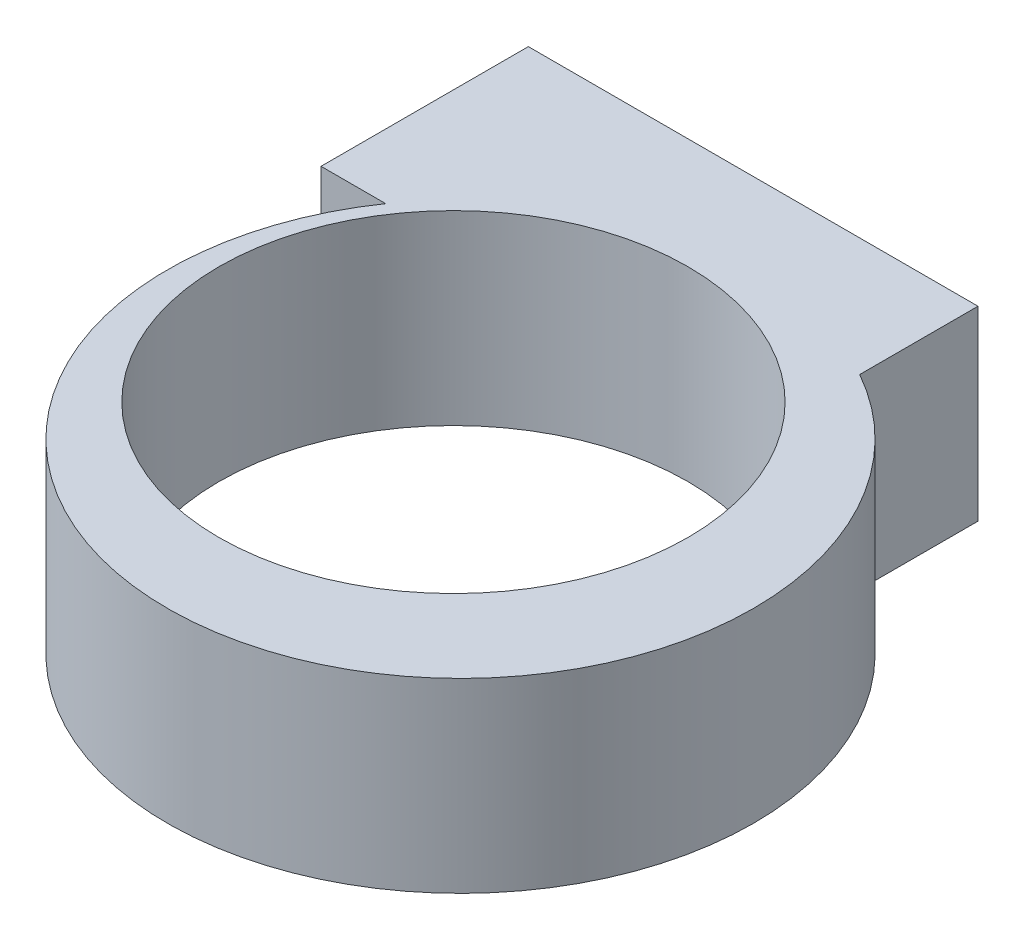
ISO-10303-21;
HEADER;
FILE_DESCRIPTION(('STEP AP214'),'2;1');
FILE_NAME('part.step','',(''),(''),'','','');
FILE_SCHEMA(('AUTOMOTIVE_DESIGN { 1 0 10303 214 1 1 1 1 }'));
ENDSEC;
DATA;
#1=APPLICATION_CONTEXT('core data for automotive mechanical design processes');
#2=APPLICATION_PROTOCOL_DEFINITION('international standard','automotive_design',2000,#1);
#3=PRODUCT_CONTEXT('',#1,'mechanical');
#4=PRODUCT('Part','Part','',(#3));
#5=PRODUCT_RELATED_PRODUCT_CATEGORY('part','',(#4));
#6=PRODUCT_DEFINITION_FORMATION('','',#4);
#7=PRODUCT_DEFINITION_CONTEXT('part definition',#1,'design');
#8=PRODUCT_DEFINITION('design','',#6,#7);
#9=PRODUCT_DEFINITION_SHAPE('','',#8);
#10=(LENGTH_UNIT() NAMED_UNIT(*) SI_UNIT(.MILLI.,.METRE.));
#11=(NAMED_UNIT(*) PLANE_ANGLE_UNIT() SI_UNIT($,.RADIAN.));
#12=(NAMED_UNIT(*) SI_UNIT($,.STERADIAN.) SOLID_ANGLE_UNIT());
#13=UNCERTAINTY_MEASURE_WITH_UNIT(LENGTH_MEASURE(1.E-05),#10,'distance_accuracy_value','');
#14=(GEOMETRIC_REPRESENTATION_CONTEXT(3) GLOBAL_UNCERTAINTY_ASSIGNED_CONTEXT((#13)) GLOBAL_UNIT_ASSIGNED_CONTEXT((#10,
#11,#12)) REPRESENTATION_CONTEXT('',''));
#15=CARTESIAN_POINT('',(0.,0.,0.));
#16=DIRECTION('',(0.,0.,1.));
#17=DIRECTION('',(1.,0.,0.));
#18=AXIS2_PLACEMENT_3D('',#15,#16,#17);
#19=CARTESIAN_POINT('',(0.,3.175,0.));
#20=DIRECTION('',(0.,-1.,0.));
#21=DIRECTION('',(0.,0.,-1.));
#22=AXIS2_PLACEMENT_3D('',#19,#20,#21);
#23=CYLINDRICAL_SURFACE('',#22,5.);
#24=CARTESIAN_POINT('',(0.,0.,0.));
#25=DIRECTION('',(0.,1.,0.));
#26=DIRECTION('',(0.,0.,1.));
#27=AXIS2_PLACEMENT_3D('',#24,#25,#26);
#28=CIRCLE('',#27,5.);
#29=CARTESIAN_POINT('',(-4.11530309650249,0.,-2.8397676707641));
#30=VERTEX_POINT('',#29);
#31=CARTESIAN_POINT('',(2.45078819699529,0.,-4.358169020755));
#32=VERTEX_POINT('',#31);
#33=EDGE_CURVE('E36',#30,#32,#28,.T.);
#34=ORIENTED_EDGE('',*,*,#33,.T.);
#35=DIRECTION('',(0.,-1.,0.));
#36=VECTOR('',#35,1.);
#37=CARTESIAN_POINT('',(2.45078819699529,3.175,-4.358169020755));
#38=LINE('',#37,#36);
#39=CARTESIAN_POINT('',(2.45078819699529,3.175,-4.358169020755));
#40=VERTEX_POINT('',#39);
#41=EDGE_CURVE('E50',#32,#40,#38,.F.);
#42=ORIENTED_EDGE('',*,*,#41,.T.);
#43=CARTESIAN_POINT('',(0.,3.175,0.));
#44=DIRECTION('',(0.,1.,0.));
#45=DIRECTION('',(0.,0.,1.));
#46=AXIS2_PLACEMENT_3D('',#43,#44,#45);
#47=CIRCLE('',#46,5.);
#48=CARTESIAN_POINT('',(-4.11530309650249,3.175,-2.8397676707641));
#49=VERTEX_POINT('',#48);
#50=EDGE_CURVE('E11',#49,#40,#47,.T.);
#51=ORIENTED_EDGE('',*,*,#50,.F.);
#52=DIRECTION('',(0.,-1.,0.));
#53=VECTOR('',#52,1.);
#54=CARTESIAN_POINT('',(-4.11530309650249,3.175,-2.8397676707641));
#55=LINE('',#54,#53);
#56=EDGE_CURVE('E93',#49,#30,#55,.T.);
#57=ORIENTED_EDGE('',*,*,#56,.T.);
#58=EDGE_LOOP('',(#34,#42,#51,#57));
#59=FACE_BOUND('',#58,.T.);
#60=ADVANCED_FACE('F33',(#59),#23,.T.);
#61=CARTESIAN_POINT('',(0.,3.175,0.));
#62=DIRECTION('',(0.,1.,0.));
#63=DIRECTION('',(0.,0.,1.));
#64=AXIS2_PLACEMENT_3D('',#61,#62,#63);
#65=PLANE('',#64);
#66=CARTESIAN_POINT('',(-0.606472723816864,3.175,-0.486614050174694));
#67=DIRECTION('',(0.,1.,0.));
#68=DIRECTION('',(0.,0.,1.));
#69=AXIS2_PLACEMENT_3D('',#66,#67,#68);
#70=CIRCLE('',#69,3.99999999999999);
#71=CARTESIAN_POINT('',(-0.606472723816864,3.175,3.51338594982529));
#72=VERTEX_POINT('',#71);
#73=EDGE_CURVE('E102',#72,#72,#70,.T.);
#74=ORIENTED_EDGE('',*,*,#73,.F.);
#75=EDGE_LOOP('',(#74));
#76=FACE_BOUND('',#75,.T.);
#77=ORIENTED_EDGE('',*,*,#50,.T.);
#78=DIRECTION('',(0.,0.,-1.));
#79=VECTOR('',#78,1.);
#80=CARTESIAN_POINT('',(2.45078819699529,3.175,-2.8397676707641));
#81=LINE('',#80,#79);
#82=CARTESIAN_POINT('',(2.45078819699529,3.175,-6.37568240648534));
#83=VERTEX_POINT('',#82);
#84=EDGE_CURVE('E95',#40,#83,#81,.T.);
#85=ORIENTED_EDGE('',*,*,#84,.T.);
#86=DIRECTION('',(-1.,0.,0.));
#87=VECTOR('',#86,1.);
#88=CARTESIAN_POINT('',(-5.21833840645058,3.175,-6.37568240648534));
#89=LINE('',#88,#87);
#90=CARTESIAN_POINT('',(-5.21833840645058,3.175,-6.37568240648534));
#91=VERTEX_POINT('',#90);
#92=EDGE_CURVE('E88',#83,#91,#89,.T.);
#93=ORIENTED_EDGE('',*,*,#92,.T.);
#94=DIRECTION('',(0.,0.,1.));
#95=VECTOR('',#94,1.);
#96=CARTESIAN_POINT('',(-5.21833840645058,3.175,-2.8397676707641));
#97=LINE('',#96,#95);
#98=CARTESIAN_POINT('',(-5.21833840645058,3.175,-2.8397676707641));
#99=VERTEX_POINT('',#98);
#100=EDGE_CURVE('E82',#91,#99,#97,.T.);
#101=ORIENTED_EDGE('',*,*,#100,.T.);
#102=DIRECTION('',(1.,0.,0.));
#103=VECTOR('',#102,1.);
#104=CARTESIAN_POINT('',(-5.21833840645058,3.175,-2.8397676707641));
#105=LINE('',#104,#103);
#106=EDGE_CURVE('E91',#99,#49,#105,.T.);
#107=ORIENTED_EDGE('',*,*,#106,.T.);
#108=EDGE_LOOP('',(#77,#85,#93,#101,#107));
#109=FACE_BOUND('',#108,.T.);
#110=ADVANCED_FACE('F97',(#76,#109),#65,.T.);
#111=CARTESIAN_POINT('',(0.,0.,0.));
#112=DIRECTION('',(0.,1.,0.));
#113=DIRECTION('',(0.,0.,1.));
#114=AXIS2_PLACEMENT_3D('',#111,#112,#113);
#115=PLANE('',#114);
#116=CARTESIAN_POINT('',(-0.606472723816864,0.,-0.486614050174694));
#117=DIRECTION('',(0.,1.,0.));
#118=DIRECTION('',(0.,0.,1.));
#119=AXIS2_PLACEMENT_3D('',#116,#117,#118);
#120=CIRCLE('',#119,4.);
#121=CARTESIAN_POINT('',(-0.606472723816864,0.,3.51338594982531));
#122=VERTEX_POINT('',#121);
#123=EDGE_CURVE('E99',#122,#122,#120,.T.);
#124=ORIENTED_EDGE('',*,*,#123,.T.);
#125=EDGE_LOOP('',(#124));
#126=FACE_BOUND('',#125,.T.);
#127=ORIENTED_EDGE('',*,*,#33,.F.);
#128=DIRECTION('',(-1.,0.,0.));
#129=VECTOR('',#128,1.);
#130=CARTESIAN_POINT('',(-5.21833840645058,0.,-2.8397676707641));
#131=LINE('',#130,#129);
#132=CARTESIAN_POINT('',(-5.21833840645058,0.,-2.8397676707641));
#133=VERTEX_POINT('',#132);
#134=EDGE_CURVE('E114',#30,#133,#131,.T.);
#135=ORIENTED_EDGE('',*,*,#134,.T.);
#136=DIRECTION('',(0.,0.,-1.));
#137=VECTOR('',#136,1.);
#138=CARTESIAN_POINT('',(-5.21833840645058,0.,-2.8397676707641));
#139=LINE('',#138,#137);
#140=CARTESIAN_POINT('',(-5.21833840645058,0.,-6.37568240648534));
#141=VERTEX_POINT('',#140);
#142=EDGE_CURVE('E84',#133,#141,#139,.T.);
#143=ORIENTED_EDGE('',*,*,#142,.T.);
#144=DIRECTION('',(1.,0.,0.));
#145=VECTOR('',#144,1.);
#146=CARTESIAN_POINT('',(-5.21833840645058,0.,-6.37568240648534));
#147=LINE('',#146,#145);
#148=CARTESIAN_POINT('',(2.45078819699529,0.,-6.37568240648534));
#149=VERTEX_POINT('',#148);
#150=EDGE_CURVE('E126',#141,#149,#147,.T.);
#151=ORIENTED_EDGE('',*,*,#150,.T.);
#152=DIRECTION('',(0.,0.,1.));
#153=VECTOR('',#152,1.);
#154=CARTESIAN_POINT('',(2.45078819699529,0.,-2.8397676707641));
#155=LINE('',#154,#153);
#156=EDGE_CURVE('E111',#149,#32,#155,.T.);
#157=ORIENTED_EDGE('',*,*,#156,.T.);
#158=EDGE_LOOP('',(#127,#135,#143,#151,#157));
#159=FACE_BOUND('',#158,.T.);
#160=ADVANCED_FACE('F124',(#126,#159),#115,.F.);
#161=CARTESIAN_POINT('',(2.45078819699529,-8.44501011710299,-2.8397676707641));
#162=DIRECTION('',(1.,0.,0.));
#163=DIRECTION('',(0.,0.,-1.));
#164=AXIS2_PLACEMENT_3D('',#161,#162,#163);
#165=PLANE('',#164);
#166=ORIENTED_EDGE('',*,*,#41,.F.);
#167=ORIENTED_EDGE('',*,*,#156,.F.);
#168=DIRECTION('',(0.,1.,0.));
#169=VECTOR('',#168,1.);
#170=CARTESIAN_POINT('',(2.45078819699529,-8.44501011710299,-6.37568240648534));
#171=LINE('',#170,#169);
#172=EDGE_CURVE('E87',#149,#83,#171,.T.);
#173=ORIENTED_EDGE('',*,*,#172,.T.);
#174=ORIENTED_EDGE('',*,*,#84,.F.);
#175=EDGE_LOOP('',(#166,#167,#173,#174));
#176=FACE_BOUND('',#175,.T.);
#177=ADVANCED_FACE('F122',(#176),#165,.T.);
#178=CARTESIAN_POINT('',(-5.21833840645058,-8.44501011710299,-2.8397676707641));
#179=DIRECTION('',(0.,0.,1.));
#180=DIRECTION('',(1.,0.,0.));
#181=AXIS2_PLACEMENT_3D('',#178,#179,#180);
#182=PLANE('',#181);
#183=ORIENTED_EDGE('',*,*,#56,.F.);
#184=ORIENTED_EDGE('',*,*,#106,.F.);
#185=DIRECTION('',(0.,1.,0.));
#186=VECTOR('',#185,1.);
#187=CARTESIAN_POINT('',(-5.21833840645058,-8.44501011710299,-2.8397676707641));
#188=LINE('',#187,#186);
#189=EDGE_CURVE('E77',#133,#99,#188,.T.);
#190=ORIENTED_EDGE('',*,*,#189,.F.);
#191=ORIENTED_EDGE('',*,*,#134,.F.);
#192=EDGE_LOOP('',(#183,#184,#190,#191));
#193=FACE_BOUND('',#192,.T.);
#194=ADVANCED_FACE('F92',(#193),#182,.T.);
#195=CARTESIAN_POINT('',(-5.21833840645058,-8.44501011710299,-2.8397676707641));
#196=DIRECTION('',(-1.,0.,0.));
#197=DIRECTION('',(0.,0.,1.));
#198=AXIS2_PLACEMENT_3D('',#195,#196,#197);
#199=PLANE('',#198);
#200=ORIENTED_EDGE('',*,*,#142,.F.);
#201=ORIENTED_EDGE('',*,*,#189,.T.);
#202=ORIENTED_EDGE('',*,*,#100,.F.);
#203=DIRECTION('',(0.,1.,0.));
#204=VECTOR('',#203,1.);
#205=CARTESIAN_POINT('',(-5.21833840645058,-8.44501011710299,-6.37568240648534));
#206=LINE('',#205,#204);
#207=EDGE_CURVE('E109',#141,#91,#206,.T.);
#208=ORIENTED_EDGE('',*,*,#207,.F.);
#209=EDGE_LOOP('',(#200,#201,#202,#208));
#210=FACE_BOUND('',#209,.T.);
#211=ADVANCED_FACE('F79',(#210),#199,.T.);
#212=CARTESIAN_POINT('',(-5.21833840645058,-8.44501011710299,-6.37568240648534));
#213=DIRECTION('',(0.,0.,-1.));
#214=DIRECTION('',(-1.,0.,0.));
#215=AXIS2_PLACEMENT_3D('',#212,#213,#214);
#216=PLANE('',#215);
#217=ORIENTED_EDGE('',*,*,#150,.F.);
#218=ORIENTED_EDGE('',*,*,#207,.T.);
#219=ORIENTED_EDGE('',*,*,#92,.F.);
#220=ORIENTED_EDGE('',*,*,#172,.F.);
#221=EDGE_LOOP('',(#217,#218,#219,#220));
#222=FACE_BOUND('',#221,.T.);
#223=ADVANCED_FACE('F145',(#222),#216,.T.);
#224=CARTESIAN_POINT('',(-0.606472723816864,3.175,-0.486614050174694));
#225=DIRECTION('',(0.,1.,0.));
#226=DIRECTION('',(0.,0.,1.));
#227=AXIS2_PLACEMENT_3D('',#224,#225,#226);
#228=CYLINDRICAL_SURFACE('',#227,3.99999999999999);
#229=ORIENTED_EDGE('',*,*,#123,.F.);
#230=EDGE_LOOP('',(#229));
#231=FACE_BOUND('',#230,.T.);
#232=ORIENTED_EDGE('',*,*,#73,.T.);
#233=EDGE_LOOP('',(#232));
#234=FACE_BOUND('',#233,.T.);
#235=ADVANCED_FACE('F132',(#231,#234),#228,.F.);
#236=CLOSED_SHELL('',(#60,#110,#160,#177,#194,#211,#223,#235));
#237=MANIFOLD_SOLID_BREP('B2',#236);
#238=ADVANCED_BREP_SHAPE_REPRESENTATION('',(#18,#237),#14);
#239=SHAPE_DEFINITION_REPRESENTATION(#9,#238);
ENDSEC;
END-ISO-10303-21;
